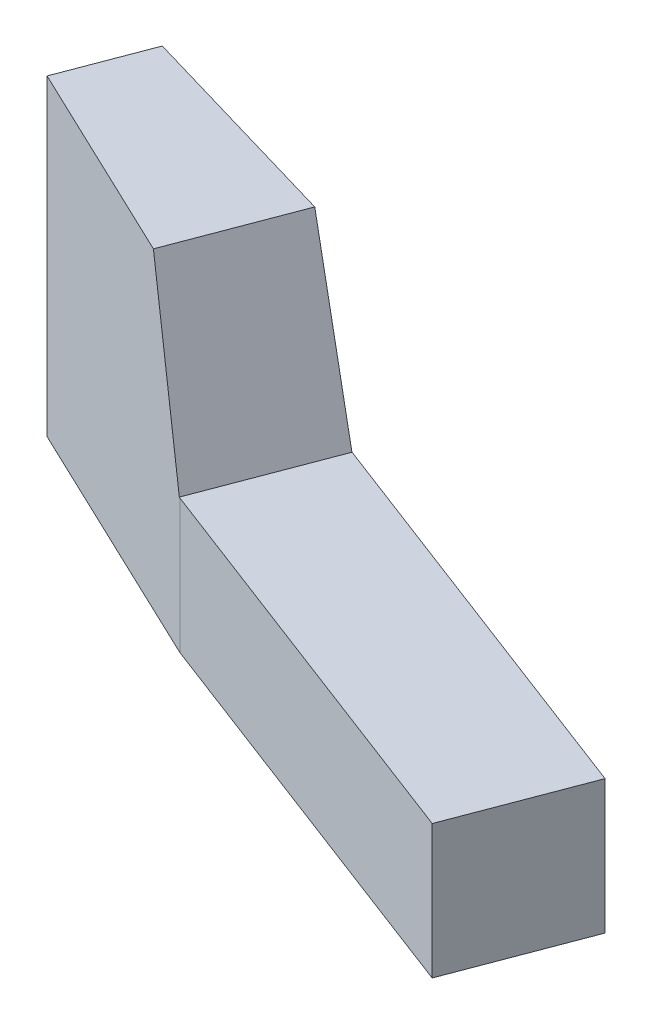
ISO-10303-21;
HEADER;
FILE_DESCRIPTION(('STEP AP214'),'2;1');
FILE_NAME('part.step','',(''),(''),'','','');
FILE_SCHEMA(('AUTOMOTIVE_DESIGN { 1 0 10303 214 1 1 1 1 }'));
ENDSEC;
DATA;
#1=APPLICATION_CONTEXT('core data for automotive mechanical design processes');
#2=APPLICATION_PROTOCOL_DEFINITION('international standard','automotive_design',2000,#1);
#3=PRODUCT_CONTEXT('',#1,'mechanical');
#4=PRODUCT('Part','Part','',(#3));
#5=PRODUCT_RELATED_PRODUCT_CATEGORY('part','',(#4));
#6=PRODUCT_DEFINITION_FORMATION('','',#4);
#7=PRODUCT_DEFINITION_CONTEXT('part definition',#1,'design');
#8=PRODUCT_DEFINITION('design','',#6,#7);
#9=PRODUCT_DEFINITION_SHAPE('','',#8);
#10=(LENGTH_UNIT() NAMED_UNIT(*) SI_UNIT(.MILLI.,.METRE.));
#11=(NAMED_UNIT(*) PLANE_ANGLE_UNIT() SI_UNIT($,.RADIAN.));
#12=(NAMED_UNIT(*) SI_UNIT($,.STERADIAN.) SOLID_ANGLE_UNIT());
#13=UNCERTAINTY_MEASURE_WITH_UNIT(LENGTH_MEASURE(1.E-05),#10,'distance_accuracy_value','');
#14=(GEOMETRIC_REPRESENTATION_CONTEXT(3) GLOBAL_UNCERTAINTY_ASSIGNED_CONTEXT((#13)) GLOBAL_UNIT_ASSIGNED_CONTEXT((#10,
#11,#12)) REPRESENTATION_CONTEXT('',''));
#15=CARTESIAN_POINT('',(0.,0.,0.));
#16=DIRECTION('',(0.,0.,1.));
#17=DIRECTION('',(1.,0.,0.));
#18=AXIS2_PLACEMENT_3D('',#15,#16,#17);
#19=CARTESIAN_POINT('',(158.721978698146,95.7300101422128,-224.351228141642));
#20=DIRECTION('',(-0.00184043141175174,-0.999997386166655,-0.00135663999540008));
#21=DIRECTION('',(-0.00129411521618025,0.0013590228891274,-0.999998239159747));
#22=AXIS2_PLACEMENT_3D('',#19,#20,#21);
#23=PLANE('',#22);
#24=DIRECTION('',(0.35536934714336,0.000614055049172824,-0.934725761946946));
#25=VECTOR('',#24,1.);
#26=CARTESIAN_POINT('',(150.440845222293,95.7538763766152,-230.709078309916));
#27=LINE('',#26,#25);
#28=CARTESIAN_POINT('',(149.730106528198,95.75264826654,-228.839626786219));
#29=VERTEX_POINT('',#28);
#30=CARTESIAN_POINT('',(151.151583916387,95.7551044866904,-232.578529833614));
#31=VERTEX_POINT('',#30);
#32=EDGE_CURVE('E35',#29,#31,#27,.T.);
#33=ORIENTED_EDGE('',*,*,#32,.F.);
#34=DIRECTION('',(0.903408308072181,-0.00224436082701667,0.428775456096356));
#35=VECTOR('',#34,1.);
#36=CARTESIAN_POINT('',(154.261579547278,95.7413906099228,-226.688900039614));
#37=LINE('',#36,#35);
#38=CARTESIAN_POINT('',(158.793052566357,95.7301329533106,-224.53817329401));
#39=VERTEX_POINT('',#38);
#40=EDGE_CURVE('E11',#29,#39,#37,.T.);
#41=ORIENTED_EDGE('',*,*,#40,.T.);
#42=DIRECTION('',(0.355369347397535,0.000614055048576321,-0.934725761850313));
#43=VECTOR('',#42,1.);
#44=CARTESIAN_POINT('',(159.788086739289,95.7318523073756,-227.155405427189));
#45=LINE('',#44,#43);
#46=CARTESIAN_POINT('',(160.783120912223,95.7335716615405,-229.772637560367));
#47=VERTEX_POINT('',#46);
#48=EDGE_CURVE('E27',#39,#47,#45,.T.);
#49=ORIENTED_EDGE('',*,*,#48,.T.);
#50=DIRECTION('',(-0.960086323261259,0.00214642491422951,-0.279695628758771));
#51=VECTOR('',#50,1.);
#52=CARTESIAN_POINT('',(155.967352414305,95.744338074168,-231.17558369749));
#53=LINE('',#52,#51);
#54=EDGE_CURVE('E151',#47,#31,#53,.T.);
#55=ORIENTED_EDGE('',*,*,#54,.T.);
#56=EDGE_LOOP('',(#33,#41,#49,#55));
#57=FACE_BOUND('',#56,.T.);
#58=ADVANCED_FACE('F17',(#57),#23,.F.);
#59=CARTESIAN_POINT('',(149.37473718115,95.7520342114523,-227.90490102437));
#60=DIRECTION('',(0.93472415172688,-0.00220240692327208,0.355367288283839));
#61=DIRECTION('',(-0.355298591201189,0.0148230313583796,0.934635323980321));
#62=AXIS2_PLACEMENT_3D('',#59,#60,#61);
#63=PLANE('',#62);
#64=DIRECTION('',(0.35536934728634,0.00061405497991439,-0.934725761892633));
#65=VECTOR('',#64,1.);
#66=CARTESIAN_POINT('',(150.415079182986,81.7539129708567,-230.72807127027));
#67=LINE('',#66,#65);
#68=CARTESIAN_POINT('',(149.704340488894,81.7526848608814,-228.858619746572));
#69=VERTEX_POINT('',#68);
#70=CARTESIAN_POINT('',(151.12581787708,81.7551410808319,-232.597522793968));
#71=VERTEX_POINT('',#70);
#72=EDGE_CURVE('E134',#69,#71,#67,.T.);
#73=ORIENTED_EDGE('',*,*,#72,.F.);
#74=DIRECTION('',(0.00184043138931552,0.999997386166616,0.00135664005437635));
#75=VECTOR('',#74,1.);
#76=CARTESIAN_POINT('',(149.717223508047,88.7526665637167,-228.849123265894));
#77=LINE('',#76,#75);
#78=EDGE_CURVE('E147',#69,#29,#77,.T.);
#79=ORIENTED_EDGE('',*,*,#78,.T.);
#80=ORIENTED_EDGE('',*,*,#32,.T.);
#81=DIRECTION('',(-0.00184043143666424,-0.999997386166698,-0.00135663993002683));
#82=VECTOR('',#81,1.);
#83=CARTESIAN_POINT('',(151.138700897229,88.7551227835552,-232.588026314293));
#84=LINE('',#83,#82);
#85=EDGE_CURVE('E123',#31,#71,#84,.T.);
#86=ORIENTED_EDGE('',*,*,#85,.T.);
#87=EDGE_LOOP('',(#73,#79,#80,#86));
#88=FACE_BOUND('',#87,.T.);
#89=ADVANCED_FACE('F157',(#88),#63,.F.);
#90=CARTESIAN_POINT('',(161.058789077397,95.7245041249766,-223.46280992071));
#91=DIRECTION('',(-0.428777380151135,-0.000436468024874866,0.903410077299557));
#92=DIRECTION('',(-0.903409583218748,-0.000944898120964531,-0.42877760216232));
#93=AXIS2_PLACEMENT_3D('',#90,#91,#92);
#94=PLANE('',#93);
#95=ORIENTED_EDGE('',*,*,#40,.F.);
#96=ORIENTED_EDGE('',*,*,#78,.F.);
#97=DIRECTION('',(-0.903408308066416,0.00224436077346744,-0.428775456108782));
#98=VECTOR('',#97,1.);
#99=CARTESIAN_POINT('',(155.368681762974,81.7386127890609,-226.170211314322));
#100=LINE('',#99,#98);
#101=CARTESIAN_POINT('',(161.033023038081,81.7245407186182,-223.481802881067));
#102=VERTEX_POINT('',#101);
#103=EDGE_CURVE('E130',#102,#69,#100,.T.);
#104=ORIENTED_EDGE('',*,*,#103,.F.);
#105=DIRECTION('',(-0.00184043134288708,-0.999997386166826,-0.00135663996269607));
#106=VECTOR('',#105,1.);
#107=CARTESIAN_POINT('',(161.038544332007,84.7245328771769,-223.477732960918));
#108=LINE('',#107,#106);
#109=CARTESIAN_POINT('',(161.044065625931,87.7245250356355,-223.47366304077));
#110=VERTEX_POINT('',#109);
#111=EDGE_CURVE('E113',#110,#102,#108,.T.);
#112=ORIENTED_EDGE('',*,*,#111,.F.);
#113=DIRECTION('',(0.903408308045937,-0.00224437203771036,0.428775456092969));
#114=VECTOR('',#113,1.);
#115=CARTESIAN_POINT('',(161.019525638373,87.7245860014708,-223.485310204501));
#116=LINE('',#115,#114);
#117=CARTESIAN_POINT('',(160.994985651799,87.7246469662843,-223.496957367238));
#118=VERTEX_POINT('',#117);
#119=EDGE_CURVE('E102',#118,#110,#116,.T.);
#120=ORIENTED_EDGE('',*,*,#119,.F.);
#121=DIRECTION('',(0.263142914965867,-0.95669888081418,0.12443093567181));
#122=VECTOR('',#121,1.);
#123=CARTESIAN_POINT('',(159.894019109589,91.7273899605439,-224.017565331621));
#124=LINE('',#123,#122);
#125=EDGE_CURVE('E120',#39,#118,#124,.T.);
#126=ORIENTED_EDGE('',*,*,#125,.F.);
#127=EDGE_LOOP('',(#95,#96,#104,#112,#120,#126));
#128=FACE_BOUND('',#127,.T.);
#129=ADVANCED_FACE('F145',(#128),#94,.T.);
#130=CARTESIAN_POINT('',(160.993446061717,87.7246443059406,-223.492907796059));
#131=DIRECTION('',(-0.894419241878954,-0.29026476829691,-0.340236071048056));
#132=DIRECTION('',(0.359703516890085,-0.0148239914574822,-0.932948888854139));
#133=AXIS2_PLACEMENT_3D('',#130,#131,#132);
#134=PLANE('',#133);
#135=ORIENTED_EDGE('',*,*,#48,.F.);
#136=ORIENTED_EDGE('',*,*,#125,.T.);
#137=DIRECTION('',(0.355369347282633,0.000614055061456347,-0.934725761893988));
#138=VECTOR('',#137,1.);
#139=CARTESIAN_POINT('',(162.059554103863,87.7264864711814,-226.297085080607));
#140=LINE('',#139,#138);
#141=CARTESIAN_POINT('',(163.124122555921,87.7283259759886,-229.097212795975));
#142=VERTEX_POINT('',#141);
#143=EDGE_CURVE('E124',#118,#142,#140,.T.);
#144=ORIENTED_EDGE('',*,*,#143,.T.);
#145=DIRECTION('',(-0.279762359992636,0.956670163560416,-0.0807169132501794));
#146=VECTOR('',#145,1.);
#147=CARTESIAN_POINT('',(161.953621734578,91.730948819106,-229.43492517817));
#148=LINE('',#147,#146);
#149=EDGE_CURVE('E127',#142,#47,#148,.T.);
#150=ORIENTED_EDGE('',*,*,#149,.T.);
#151=EDGE_LOOP('',(#135,#136,#144,#150));
#152=FACE_BOUND('',#151,.T.);
#153=ADVANCED_FACE('F162',(#152),#134,.F.);
#154=CARTESIAN_POINT('',(151.151583917389,95.7551044867734,-232.578529833615));
#155=DIRECTION('',(-0.2796978096453,-0.000787730884192876,0.96008776409226));
#156=DIRECTION('',(-0.960087407430913,0.00141951029946832,-0.279696541063878));
#157=AXIS2_PLACEMENT_3D('',#154,#155,#156);
#158=PLANE('',#157);
#159=DIRECTION('',(-0.960086323242251,0.00214642912232525,-0.279695628791727));
#160=VECTOR('',#159,1.);
#161=CARTESIAN_POINT('',(163.150202132574,87.7282676712139,-229.089615203418));
#162=LINE('',#161,#160);
#163=CARTESIAN_POINT('',(163.176281709215,87.7282093659442,-229.082017611865));
#164=VERTEX_POINT('',#163);
#165=EDGE_CURVE('E96',#164,#142,#162,.T.);
#166=ORIENTED_EDGE('',*,*,#165,.F.);
#167=DIRECTION('',(0.00184043136202358,0.999997386166766,0.00135663998090375));
#168=VECTOR('',#167,1.);
#169=CARTESIAN_POINT('',(163.170760415294,84.7282172075855,-229.086087532012));
#170=LINE('',#169,#168);
#171=CARTESIAN_POINT('',(163.165239120366,81.7282250489439,-229.09015745216));
#172=VERTEX_POINT('',#171);
#173=EDGE_CURVE('E91',#172,#164,#170,.T.);
#174=ORIENTED_EDGE('',*,*,#173,.F.);
#175=DIRECTION('',(0.960086323249881,-0.00214642493633545,0.279695628797659));
#176=VECTOR('',#175,1.);
#177=CARTESIAN_POINT('',(157.145528499222,81.7416830648819,-230.843840123564));
#178=LINE('',#177,#176);
#179=EDGE_CURVE('E132',#71,#172,#178,.T.);
#180=ORIENTED_EDGE('',*,*,#179,.F.);
#181=ORIENTED_EDGE('',*,*,#85,.F.);
#182=ORIENTED_EDGE('',*,*,#54,.F.);
#183=ORIENTED_EDGE('',*,*,#149,.F.);
#184=EDGE_LOOP('',(#166,#174,#180,#181,#182,#183));
#185=FACE_BOUND('',#184,.T.);
#186=ADVANCED_FACE('F160',(#185),#158,.F.);
#187=CARTESIAN_POINT('',(149.348971140835,81.7520708052109,-227.923893984725));
#188=DIRECTION('',(0.00184043141175175,0.999997386166655,0.00135663999541008));
#189=DIRECTION('',(0.00129411521618031,-0.0013590228891374,0.999998239159747));
#190=AXIS2_PLACEMENT_3D('',#187,#188,#189);
#191=PLANE('',#190);
#192=DIRECTION('',(0.934724151735988,-0.00220240692320438,0.355367288259881));
#193=VECTOR('',#192,1.);
#194=CARTESIAN_POINT('',(170.146583516953,81.7030672511616,-220.016971819631));
#195=LINE('',#194,#193);
#196=CARTESIAN_POINT('',(179.260143996824,81.6815937835931,-216.552140759198));
#197=VERTEX_POINT('',#196);
#198=EDGE_CURVE('E114',#102,#197,#195,.T.);
#199=ORIENTED_EDGE('',*,*,#198,.F.);
#200=ORIENTED_EDGE('',*,*,#103,.T.);
#201=ORIENTED_EDGE('',*,*,#72,.T.);
#202=ORIENTED_EDGE('',*,*,#179,.T.);
#203=DIRECTION('',(0.934724151735988,-0.00220240692320438,0.355367288259881));
#204=VECTOR('',#203,1.);
#205=CARTESIAN_POINT('',(172.278799600237,81.7067515813703,-225.625326390726));
#206=LINE('',#205,#204);
#207=CARTESIAN_POINT('',(181.392360079109,81.6852781139187,-222.160495330291));
#208=VERTEX_POINT('',#207);
#209=EDGE_CURVE('E110',#172,#208,#206,.T.);
#210=ORIENTED_EDGE('',*,*,#209,.T.);
#211=DIRECTION('',(0.355369347195443,0.000614055049040237,-0.934725761927145));
#212=VECTOR('',#211,1.);
#213=CARTESIAN_POINT('',(180.326252037966,81.6834359487559,-219.356318044745));
#214=LINE('',#213,#212);
#215=EDGE_CURVE('E104',#197,#208,#214,.T.);
#216=ORIENTED_EDGE('',*,*,#215,.F.);
#217=EDGE_LOOP('',(#199,#200,#201,#202,#210,#216));
#218=FACE_BOUND('',#217,.T.);
#219=ADVANCED_FACE('F139',(#218),#191,.F.);
#220=CARTESIAN_POINT('',(149.37473718115,95.7520342114523,-227.90490102437));
#221=DIRECTION('',(-0.355369347286255,-0.00061405504882516,0.93472576189262));
#222=DIRECTION('',(-0.934725963580128,0.00023806157596705,-0.355369267573726));
#223=AXIS2_PLACEMENT_3D('',#220,#221,#222);
#224=PLANE('',#223);
#225=DIRECTION('',(-0.934724151726853,0.00220240693367084,-0.355367288283844));
#226=VECTOR('',#225,1.);
#227=CARTESIAN_POINT('',(170.1576261058,87.703051568067,-220.008831980337));
#228=LINE('',#227,#226);
#229=CARTESIAN_POINT('',(179.271186585676,87.6815781007984,-216.544000919902));
#230=VERTEX_POINT('',#229);
#231=EDGE_CURVE('E100',#230,#110,#228,.T.);
#232=ORIENTED_EDGE('',*,*,#231,.T.);
#233=ORIENTED_EDGE('',*,*,#111,.T.);
#234=ORIENTED_EDGE('',*,*,#198,.T.);
#235=DIRECTION('',(0.00184043137702353,0.999997386166737,0.00135663998220345));
#236=VECTOR('',#235,1.);
#237=CARTESIAN_POINT('',(179.26566529175,84.6815859421348,-216.548070839051));
#238=LINE('',#237,#236);
#239=EDGE_CURVE('E80',#197,#230,#238,.T.);
#240=ORIENTED_EDGE('',*,*,#239,.T.);
#241=EDGE_LOOP('',(#232,#233,#234,#240));
#242=FACE_BOUND('',#241,.T.);
#243=ADVANCED_FACE('F141',(#242),#224,.T.);
#244=CARTESIAN_POINT('',(179.271186584674,87.6815781006104,-216.544000918902));
#245=DIRECTION('',(-0.00184043141175174,-0.999997386166655,-0.00135663999540008));
#246=DIRECTION('',(-0.00129411521618034,0.0013590228891274,-0.999998239159747));
#247=AXIS2_PLACEMENT_3D('',#244,#245,#246);
#248=PLANE('',#247);
#249=ORIENTED_EDGE('',*,*,#143,.F.);
#250=ORIENTED_EDGE('',*,*,#119,.T.);
#251=ORIENTED_EDGE('',*,*,#231,.F.);
#252=DIRECTION('',(0.355369347195443,0.000614055049040237,-0.934725761927145));
#253=VECTOR('',#252,1.);
#254=CARTESIAN_POINT('',(180.337294626815,87.6834202657613,-219.34817820545));
#255=LINE('',#254,#253);
#256=CARTESIAN_POINT('',(181.403402668954,87.6852624307072,-222.152355490998));
#257=VERTEX_POINT('',#256);
#258=EDGE_CURVE('E95',#230,#257,#255,.T.);
#259=ORIENTED_EDGE('',*,*,#258,.T.);
#260=DIRECTION('',(-0.934724151735988,0.00220240692320438,-0.355367288259881));
#261=VECTOR('',#260,1.);
#262=CARTESIAN_POINT('',(172.289842189086,87.7067358983757,-225.617186551431));
#263=LINE('',#262,#261);
#264=EDGE_CURVE('E86',#257,#164,#263,.T.);
#265=ORIENTED_EDGE('',*,*,#264,.T.);
#266=ORIENTED_EDGE('',*,*,#165,.T.);
#267=EDGE_LOOP('',(#249,#250,#251,#259,#265,#266));
#268=FACE_BOUND('',#267,.T.);
#269=ADVANCED_FACE('F99',(#268),#248,.F.);
#270=CARTESIAN_POINT('',(151.506953264434,95.7557185417661,-233.513255596464));
#271=DIRECTION('',(-0.355369347286255,-0.00061405504882516,0.93472576189262));
#272=DIRECTION('',(-0.934725963580128,0.00023806157596705,-0.355369267573726));
#273=AXIS2_PLACEMENT_3D('',#270,#271,#272);
#274=PLANE('',#273);
#275=ORIENTED_EDGE('',*,*,#209,.F.);
#276=ORIENTED_EDGE('',*,*,#173,.T.);
#277=ORIENTED_EDGE('',*,*,#264,.F.);
#278=DIRECTION('',(0.00184043137702353,0.999997386166737,0.00135663998220345));
#279=VECTOR('',#278,1.);
#280=CARTESIAN_POINT('',(181.397881375035,84.6852702724434,-222.156425410145));
#281=LINE('',#280,#279);
#282=EDGE_CURVE('E21',#208,#257,#281,.T.);
#283=ORIENTED_EDGE('',*,*,#282,.F.);
#284=EDGE_LOOP('',(#275,#276,#277,#283));
#285=FACE_BOUND('',#284,.T.);
#286=ADVANCED_FACE('F89',(#285),#274,.F.);
#287=CARTESIAN_POINT('',(179.260143996824,81.6815937835931,-216.552140759198));
#288=DIRECTION('',(-0.934724151726877,0.00220240692447197,-0.355367288283841));
#289=DIRECTION('',(0.355298591201174,-0.0148230313583795,-0.934635323980326));
#290=AXIS2_PLACEMENT_3D('',#287,#288,#289);
#291=PLANE('',#290);
#292=ORIENTED_EDGE('',*,*,#282,.T.);
#293=ORIENTED_EDGE('',*,*,#258,.F.);
#294=ORIENTED_EDGE('',*,*,#239,.F.);
#295=ORIENTED_EDGE('',*,*,#215,.T.);
#296=EDGE_LOOP('',(#292,#293,#294,#295));
#297=FACE_BOUND('',#296,.T.);
#298=ADVANCED_FACE('F19',(#297),#291,.F.);
#299=CLOSED_SHELL('',(#58,#89,#129,#153,#186,#219,#243,#269,#286,#298));
#300=MANIFOLD_SOLID_BREP('B1',#299);
#301=ADVANCED_BREP_SHAPE_REPRESENTATION('',(#18,#300),#14);
#302=SHAPE_DEFINITION_REPRESENTATION(#9,#301);
ENDSEC;
END-ISO-10303-21;
